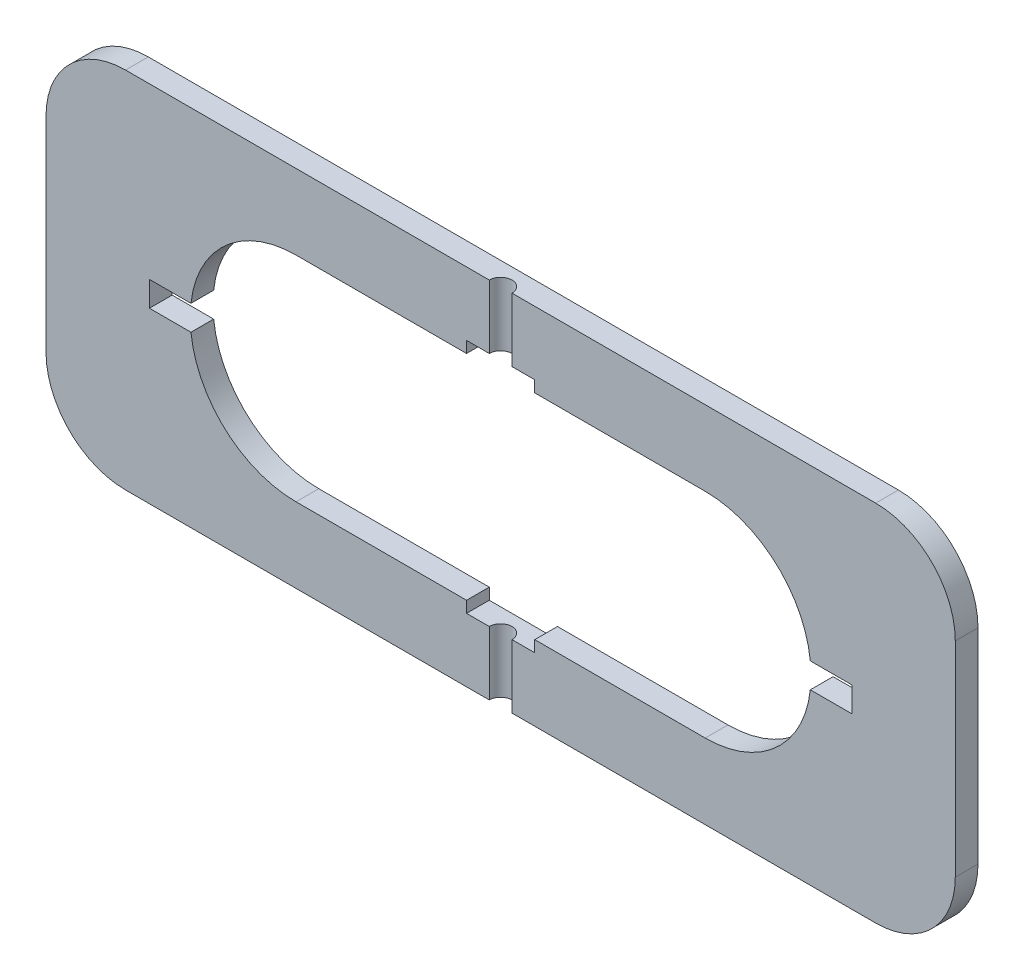
ISO-10303-21;
HEADER;
FILE_DESCRIPTION(('STEP AP214'),'2;1');
FILE_NAME('part.step','',(''),(''),'','','');
FILE_SCHEMA(('AUTOMOTIVE_DESIGN { 1 0 10303 214 1 1 1 1 }'));
ENDSEC;
DATA;
#1=APPLICATION_CONTEXT('core data for automotive mechanical design processes');
#2=APPLICATION_PROTOCOL_DEFINITION('international standard','automotive_design',2000,#1);
#3=PRODUCT_CONTEXT('',#1,'mechanical');
#4=PRODUCT('Part','Part','',(#3));
#5=PRODUCT_RELATED_PRODUCT_CATEGORY('part','',(#4));
#6=PRODUCT_DEFINITION_FORMATION('','',#4);
#7=PRODUCT_DEFINITION_CONTEXT('part definition',#1,'design');
#8=PRODUCT_DEFINITION('design','',#6,#7);
#9=PRODUCT_DEFINITION_SHAPE('','',#8);
#10=(LENGTH_UNIT() NAMED_UNIT(*) SI_UNIT(.MILLI.,.METRE.));
#11=(NAMED_UNIT(*) PLANE_ANGLE_UNIT() SI_UNIT($,.RADIAN.));
#12=(NAMED_UNIT(*) SI_UNIT($,.STERADIAN.) SOLID_ANGLE_UNIT());
#13=UNCERTAINTY_MEASURE_WITH_UNIT(LENGTH_MEASURE(1.E-05),#10,'distance_accuracy_value','');
#14=(GEOMETRIC_REPRESENTATION_CONTEXT(3) GLOBAL_UNCERTAINTY_ASSIGNED_CONTEXT((#13)) GLOBAL_UNIT_ASSIGNED_CONTEXT((#10,
#11,#12)) REPRESENTATION_CONTEXT('',''));
#15=CARTESIAN_POINT('',(0.,0.,0.));
#16=DIRECTION('',(0.,0.,1.));
#17=DIRECTION('',(1.,0.,0.));
#18=AXIS2_PLACEMENT_3D('',#15,#16,#17);
#19=CARTESIAN_POINT('',(165.,45.,10.));
#20=DIRECTION('',(0.,0.,-1.));
#21=DIRECTION('',(-1.,0.,0.));
#22=AXIS2_PLACEMENT_3D('',#19,#20,#21);
#23=PLANE('',#22);
#24=DIRECTION('',(-1.,0.,0.));
#25=VECTOR('',#24,1.);
#26=CARTESIAN_POINT('',(165.,80.,10.));
#27=LINE('',#26,#25);
#28=CARTESIAN_POINT('',(165.,80.,10.));
#29=VERTEX_POINT('',#28);
#30=CARTESIAN_POINT('',(4.99999999999996,80.,10.));
#31=VERTEX_POINT('',#30);
#32=EDGE_CURVE('E252',#29,#31,#27,.T.);
#33=ORIENTED_EDGE('',*,*,#32,.T.);
#34=DIRECTION('',(0.,-1.,0.));
#35=VECTOR('',#34,1.);
#36=CARTESIAN_POINT('',(4.99999999999996,80.,10.));
#37=LINE('',#36,#35);
#38=CARTESIAN_POINT('',(4.99999999999997,52.,10.));
#39=VERTEX_POINT('',#38);
#40=EDGE_CURVE('E237',#31,#39,#37,.T.);
#41=ORIENTED_EDGE('',*,*,#40,.T.);
#42=DIRECTION('',(-1.,0.,0.));
#43=VECTOR('',#42,1.);
#44=CARTESIAN_POINT('',(15.,52.,10.));
#45=LINE('',#44,#43);
#46=CARTESIAN_POINT('',(15.,52.,10.));
#47=VERTEX_POINT('',#46);
#48=EDGE_CURVE('E489',#47,#39,#45,.T.);
#49=ORIENTED_EDGE('',*,*,#48,.F.);
#50=DIRECTION('',(0.,1.,0.));
#51=VECTOR('',#50,1.);
#52=CARTESIAN_POINT('',(15.,-52.,10.));
#53=LINE('',#52,#51);
#54=CARTESIAN_POINT('',(15.,47.,10.));
#55=VERTEX_POINT('',#54);
#56=EDGE_CURVE('E485',#55,#47,#53,.T.);
#57=ORIENTED_EDGE('',*,*,#56,.F.);
#58=DIRECTION('',(-1.,0.,0.));
#59=VECTOR('',#58,1.);
#60=CARTESIAN_POINT('',(89.9999999999997,47.,10.));
#61=LINE('',#60,#59);
#62=CARTESIAN_POINT('',(89.9999999999997,47.,10.));
#63=VERTEX_POINT('',#62);
#64=EDGE_CURVE('E350',#63,#55,#61,.T.);
#65=ORIENTED_EDGE('',*,*,#64,.F.);
#66=CARTESIAN_POINT('',(90.,0.500000000000014,10.));
#67=DIRECTION('',(0.,0.,1.));
#68=DIRECTION('',(-1.,0.,0.));
#69=AXIS2_PLACEMENT_3D('',#66,#67,#68);
#70=CIRCLE('',#69,46.5);
#71=CARTESIAN_POINT('',(136.230401252855,5.5,10.));
#72=VERTEX_POINT('',#71);
#73=EDGE_CURVE('E351',#72,#63,#70,.T.);
#74=ORIENTED_EDGE('',*,*,#73,.F.);
#75=DIRECTION('',(-1.,0.,0.));
#76=VECTOR('',#75,1.);
#77=CARTESIAN_POINT('',(154.5,5.5,10.));
#78=LINE('',#77,#76);
#79=CARTESIAN_POINT('',(154.5,5.5,10.));
#80=VERTEX_POINT('',#79);
#81=EDGE_CURVE('E443',#80,#72,#78,.T.);
#82=ORIENTED_EDGE('',*,*,#81,.F.);
#83=DIRECTION('',(0.,1.,0.));
#84=VECTOR('',#83,1.);
#85=CARTESIAN_POINT('',(154.5,-5.5,10.));
#86=LINE('',#85,#84);
#87=CARTESIAN_POINT('',(154.5,-5.5,10.));
#88=VERTEX_POINT('',#87);
#89=EDGE_CURVE('E455',#88,#80,#86,.T.);
#90=ORIENTED_EDGE('',*,*,#89,.F.);
#91=DIRECTION('',(1.,0.,0.));
#92=VECTOR('',#91,1.);
#93=CARTESIAN_POINT('',(154.5,-5.5,10.));
#94=LINE('',#93,#92);
#95=CARTESIAN_POINT('',(136.230401252855,-5.5,10.));
#96=VERTEX_POINT('',#95);
#97=EDGE_CURVE('E433',#96,#88,#94,.T.);
#98=ORIENTED_EDGE('',*,*,#97,.F.);
#99=CARTESIAN_POINT('',(90.0000000000001,-0.5,10.));
#100=DIRECTION('',(0.,0.,1.));
#101=DIRECTION('',(-1.,0.,0.));
#102=AXIS2_PLACEMENT_3D('',#99,#100,#101);
#103=CIRCLE('',#102,46.5);
#104=CARTESIAN_POINT('',(89.9999999999997,-47.,10.));
#105=VERTEX_POINT('',#104);
#106=EDGE_CURVE('E354',#105,#96,#103,.T.);
#107=ORIENTED_EDGE('',*,*,#106,.F.);
#108=DIRECTION('',(1.,0.,0.));
#109=VECTOR('',#108,1.);
#110=CARTESIAN_POINT('',(89.9999999999997,-47.,10.));
#111=LINE('',#110,#109);
#112=CARTESIAN_POINT('',(15.,-47.,10.));
#113=VERTEX_POINT('',#112);
#114=EDGE_CURVE('E361',#113,#105,#111,.T.);
#115=ORIENTED_EDGE('',*,*,#114,.F.);
#116=CARTESIAN_POINT('',(15.,-52.,10.));
#117=VERTEX_POINT('',#116);
#118=EDGE_CURVE('E486',#117,#113,#53,.T.);
#119=ORIENTED_EDGE('',*,*,#118,.F.);
#120=DIRECTION('',(1.,0.,0.));
#121=VECTOR('',#120,1.);
#122=CARTESIAN_POINT('',(15.,-52.,10.));
#123=LINE('',#122,#121);
#124=CARTESIAN_POINT('',(4.99999999999998,-52.,10.));
#125=VERTEX_POINT('',#124);
#126=EDGE_CURVE('E479',#125,#117,#123,.T.);
#127=ORIENTED_EDGE('',*,*,#126,.F.);
#128=CARTESIAN_POINT('',(4.99999999999998,-80.,10.));
#129=VERTEX_POINT('',#128);
#130=EDGE_CURVE('E54',#125,#129,#37,.T.);
#131=ORIENTED_EDGE('',*,*,#130,.T.);
#132=DIRECTION('',(1.,0.,0.));
#133=VECTOR('',#132,1.);
#134=CARTESIAN_POINT('',(165.,-80.,10.));
#135=LINE('',#134,#133);
#136=CARTESIAN_POINT('',(165.,-80.,10.));
#137=VERTEX_POINT('',#136);
#138=EDGE_CURVE('E272',#129,#137,#135,.T.);
#139=ORIENTED_EDGE('',*,*,#138,.T.);
#140=CARTESIAN_POINT('',(165.,-45.,10.));
#141=DIRECTION('',(0.,0.,1.));
#142=DIRECTION('',(-1.,0.,0.));
#143=AXIS2_PLACEMENT_3D('',#140,#141,#142);
#144=CIRCLE('',#143,35.);
#145=CARTESIAN_POINT('',(200.,-44.9999999999997,10.));
#146=VERTEX_POINT('',#145);
#147=EDGE_CURVE('E276',#137,#146,#144,.T.);
#148=ORIENTED_EDGE('',*,*,#147,.T.);
#149=DIRECTION('',(0.,1.,0.));
#150=VECTOR('',#149,1.);
#151=CARTESIAN_POINT('',(200.,44.9999999999998,10.));
#152=LINE('',#151,#150);
#153=CARTESIAN_POINT('',(200.,44.9999999999998,10.));
#154=VERTEX_POINT('',#153);
#155=EDGE_CURVE('E278',#146,#154,#152,.T.);
#156=ORIENTED_EDGE('',*,*,#155,.T.);
#157=CARTESIAN_POINT('',(165.,45.,10.));
#158=DIRECTION('',(0.,0.,1.));
#159=DIRECTION('',(-1.,0.,0.));
#160=AXIS2_PLACEMENT_3D('',#157,#158,#159);
#161=CIRCLE('',#160,35.);
#162=EDGE_CURVE('E260',#154,#29,#161,.T.);
#163=ORIENTED_EDGE('',*,*,#162,.T.);
#164=EDGE_LOOP('',(#33,#41,#49,#57,#65,#74,#82,#90,#98,#107,#115,#119,#127,#131,#139,#148,#156,#163));
#165=FACE_BOUND('',#164,.T.);
#166=ADVANCED_FACE('F31',(#165),#23,.F.);
#167=CARTESIAN_POINT('',(89.9999999999997,-47.,0.));
#168=DIRECTION('',(0.,-1.,0.));
#169=DIRECTION('',(1.,0.,0.));
#170=AXIS2_PLACEMENT_3D('',#167,#168,#169);
#171=PLANE('',#170);
#172=CARTESIAN_POINT('',(-89.9999999999996,-47.,10.));
#173=VERTEX_POINT('',#172);
#174=CARTESIAN_POINT('',(-15.,-47.,10.));
#175=VERTEX_POINT('',#174);
#176=EDGE_CURVE('E362',#173,#175,#111,.T.);
#177=ORIENTED_EDGE('',*,*,#176,.T.);
#178=DIRECTION('',(0.,0.,-1.));
#179=VECTOR('',#178,1.);
#180=CARTESIAN_POINT('',(-15.,-47.,0.));
#181=LINE('',#180,#179);
#182=CARTESIAN_POINT('',(-15.,-47.,0.));
#183=VERTEX_POINT('',#182);
#184=EDGE_CURVE('E426',#175,#183,#181,.T.);
#185=ORIENTED_EDGE('',*,*,#184,.T.);
#186=DIRECTION('',(1.,0.,0.));
#187=VECTOR('',#186,1.);
#188=CARTESIAN_POINT('',(89.9999999999997,-47.,0.));
#189=LINE('',#188,#187);
#190=CARTESIAN_POINT('',(-89.9999999999996,-47.,0.));
#191=VERTEX_POINT('',#190);
#192=EDGE_CURVE('E374',#191,#183,#189,.T.);
#193=ORIENTED_EDGE('',*,*,#192,.F.);
#194=DIRECTION('',(0.,0.,1.));
#195=VECTOR('',#194,1.);
#196=CARTESIAN_POINT('',(-89.9999999999996,-47.,0.));
#197=LINE('',#196,#195);
#198=EDGE_CURVE('E368',#191,#173,#197,.T.);
#199=ORIENTED_EDGE('',*,*,#198,.T.);
#200=EDGE_LOOP('',(#177,#185,#193,#199));
#201=FACE_BOUND('',#200,.T.);
#202=ADVANCED_FACE('F425',(#201),#171,.F.);
#203=CARTESIAN_POINT('',(89.9999999999997,47.,0.));
#204=DIRECTION('',(0.,1.,0.));
#205=DIRECTION('',(-1.,0.,0.));
#206=AXIS2_PLACEMENT_3D('',#203,#204,#205);
#207=PLANE('',#206);
#208=DIRECTION('',(-1.,0.,0.));
#209=VECTOR('',#208,1.);
#210=CARTESIAN_POINT('',(89.9999999999997,47.,0.));
#211=LINE('',#210,#209);
#212=CARTESIAN_POINT('',(-15.,47.,0.));
#213=VERTEX_POINT('',#212);
#214=CARTESIAN_POINT('',(-89.9999999999996,47.,0.));
#215=VERTEX_POINT('',#214);
#216=EDGE_CURVE('E337',#213,#215,#211,.T.);
#217=ORIENTED_EDGE('',*,*,#216,.F.);
#218=DIRECTION('',(0.,0.,1.));
#219=VECTOR('',#218,1.);
#220=CARTESIAN_POINT('',(-15.,47.,0.));
#221=LINE('',#220,#219);
#222=CARTESIAN_POINT('',(-15.,47.,10.));
#223=VERTEX_POINT('',#222);
#224=EDGE_CURVE('E39',#213,#223,#221,.T.);
#225=ORIENTED_EDGE('',*,*,#224,.T.);
#226=CARTESIAN_POINT('',(-89.9999999999996,47.,10.));
#227=VERTEX_POINT('',#226);
#228=EDGE_CURVE('E335',#223,#227,#61,.T.);
#229=ORIENTED_EDGE('',*,*,#228,.T.);
#230=DIRECTION('',(0.,0.,1.));
#231=VECTOR('',#230,1.);
#232=CARTESIAN_POINT('',(-89.9999999999996,47.,0.));
#233=LINE('',#232,#231);
#234=EDGE_CURVE('E371',#215,#227,#233,.T.);
#235=ORIENTED_EDGE('',*,*,#234,.F.);
#236=EDGE_LOOP('',(#217,#225,#229,#235));
#237=FACE_BOUND('',#236,.T.);
#238=ADVANCED_FACE('F333',(#237),#207,.F.);
#239=CARTESIAN_POINT('',(165.,45.,10.));
#240=DIRECTION('',(0.,0.,-1.));
#241=DIRECTION('',(-1.,0.,0.));
#242=AXIS2_PLACEMENT_3D('',#239,#240,#241);
#243=CYLINDRICAL_SURFACE('',#242,35.);
#244=CARTESIAN_POINT('',(165.,45.,0.));
#245=DIRECTION('',(0.,0.,1.));
#246=DIRECTION('',(-1.,0.,0.));
#247=AXIS2_PLACEMENT_3D('',#244,#245,#246);
#248=CIRCLE('',#247,35.);
#249=CARTESIAN_POINT('',(200.,44.9999999999998,0.));
#250=VERTEX_POINT('',#249);
#251=CARTESIAN_POINT('',(165.,80.,0.));
#252=VERTEX_POINT('',#251);
#253=EDGE_CURVE('E281',#250,#252,#248,.T.);
#254=ORIENTED_EDGE('',*,*,#253,.T.);
#255=DIRECTION('',(0.,0.,-1.));
#256=VECTOR('',#255,1.);
#257=CARTESIAN_POINT('',(165.,80.,10.));
#258=LINE('',#257,#256);
#259=EDGE_CURVE('E319',#29,#252,#258,.T.);
#260=ORIENTED_EDGE('',*,*,#259,.F.);
#261=ORIENTED_EDGE('',*,*,#162,.F.);
#262=DIRECTION('',(0.,0.,-1.));
#263=VECTOR('',#262,1.);
#264=CARTESIAN_POINT('',(200.,44.9999999999998,10.));
#265=LINE('',#264,#263);
#266=EDGE_CURVE('E280',#154,#250,#265,.T.);
#267=ORIENTED_EDGE('',*,*,#266,.T.);
#268=EDGE_LOOP('',(#254,#260,#261,#267));
#269=FACE_BOUND('',#268,.T.);
#270=ADVANCED_FACE('F33',(#269),#243,.T.);
#271=CARTESIAN_POINT('',(165.,80.,10.));
#272=DIRECTION('',(0.,-1.,0.));
#273=DIRECTION('',(1.,0.,0.));
#274=AXIS2_PLACEMENT_3D('',#271,#272,#273);
#275=PLANE('',#274);
#276=CARTESIAN_POINT('',(-5.00000000000004,80.,10.));
#277=VERTEX_POINT('',#276);
#278=CARTESIAN_POINT('',(-165.,80.,10.));
#279=VERTEX_POINT('',#278);
#280=EDGE_CURVE('E255',#277,#279,#27,.T.);
#281=ORIENTED_EDGE('',*,*,#280,.F.);
#282=CARTESIAN_POINT('',(0.,80.,10.));
#283=DIRECTION('',(0.,-1.,0.));
#284=DIRECTION('',(1.,0.,0.));
#285=AXIS2_PLACEMENT_3D('',#282,#283,#284);
#286=CIRCLE('',#285,5.);
#287=EDGE_CURVE('E240',#277,#31,#286,.T.);
#288=ORIENTED_EDGE('',*,*,#287,.T.);
#289=ORIENTED_EDGE('',*,*,#32,.F.);
#290=ORIENTED_EDGE('',*,*,#259,.T.);
#291=DIRECTION('',(-1.,0.,0.));
#292=VECTOR('',#291,1.);
#293=CARTESIAN_POINT('',(165.,80.,0.));
#294=LINE('',#293,#292);
#295=CARTESIAN_POINT('',(-165.,80.,0.));
#296=VERTEX_POINT('',#295);
#297=EDGE_CURVE('E284',#252,#296,#294,.T.);
#298=ORIENTED_EDGE('',*,*,#297,.T.);
#299=DIRECTION('',(0.,0.,-1.));
#300=VECTOR('',#299,1.);
#301=CARTESIAN_POINT('',(-165.,80.,10.));
#302=LINE('',#301,#300);
#303=EDGE_CURVE('E316',#279,#296,#302,.T.);
#304=ORIENTED_EDGE('',*,*,#303,.F.);
#305=EDGE_LOOP('',(#281,#288,#289,#290,#298,#304));
#306=FACE_BOUND('',#305,.T.);
#307=ADVANCED_FACE('F250',(#306),#275,.F.);
#308=CARTESIAN_POINT('',(-165.,45.,10.));
#309=DIRECTION('',(0.,0.,-1.));
#310=DIRECTION('',(-1.,0.,0.));
#311=AXIS2_PLACEMENT_3D('',#308,#309,#310);
#312=CYLINDRICAL_SURFACE('',#311,35.);
#313=CARTESIAN_POINT('',(-165.,45.,0.));
#314=DIRECTION('',(0.,0.,1.));
#315=DIRECTION('',(1.,0.,0.));
#316=AXIS2_PLACEMENT_3D('',#313,#314,#315);
#317=CIRCLE('',#316,35.);
#318=CARTESIAN_POINT('',(-200.,44.9999999999997,0.));
#319=VERTEX_POINT('',#318);
#320=EDGE_CURVE('E287',#296,#319,#317,.T.);
#321=ORIENTED_EDGE('',*,*,#320,.T.);
#322=DIRECTION('',(0.,0.,-1.));
#323=VECTOR('',#322,1.);
#324=CARTESIAN_POINT('',(-200.,44.9999999999997,10.));
#325=LINE('',#324,#323);
#326=CARTESIAN_POINT('',(-200.,44.9999999999997,10.));
#327=VERTEX_POINT('',#326);
#328=EDGE_CURVE('E313',#327,#319,#325,.T.);
#329=ORIENTED_EDGE('',*,*,#328,.F.);
#330=CARTESIAN_POINT('',(-165.,45.,10.));
#331=DIRECTION('',(0.,0.,1.));
#332=DIRECTION('',(1.,0.,0.));
#333=AXIS2_PLACEMENT_3D('',#330,#331,#332);
#334=CIRCLE('',#333,35.);
#335=EDGE_CURVE('E262',#279,#327,#334,.T.);
#336=ORIENTED_EDGE('',*,*,#335,.F.);
#337=ORIENTED_EDGE('',*,*,#303,.T.);
#338=EDGE_LOOP('',(#321,#329,#336,#337));
#339=FACE_BOUND('',#338,.T.);
#340=ADVANCED_FACE('F543',(#339),#312,.T.);
#341=CARTESIAN_POINT('',(-200.,44.9999999999997,10.));
#342=DIRECTION('',(1.,0.,0.));
#343=DIRECTION('',(0.,1.,0.));
#344=AXIS2_PLACEMENT_3D('',#341,#342,#343);
#345=PLANE('',#344);
#346=DIRECTION('',(0.,-1.,0.));
#347=VECTOR('',#346,1.);
#348=CARTESIAN_POINT('',(-200.,44.9999999999997,0.));
#349=LINE('',#348,#347);
#350=CARTESIAN_POINT('',(-200.,-44.9999999999998,0.));
#351=VERTEX_POINT('',#350);
#352=EDGE_CURVE('E289',#319,#351,#349,.T.);
#353=ORIENTED_EDGE('',*,*,#352,.T.);
#354=DIRECTION('',(0.,0.,-1.));
#355=VECTOR('',#354,1.);
#356=CARTESIAN_POINT('',(-200.,-44.9999999999998,10.));
#357=LINE('',#356,#355);
#358=CARTESIAN_POINT('',(-200.,-44.9999999999998,10.));
#359=VERTEX_POINT('',#358);
#360=EDGE_CURVE('E310',#359,#351,#357,.T.);
#361=ORIENTED_EDGE('',*,*,#360,.F.);
#362=DIRECTION('',(0.,-1.,0.));
#363=VECTOR('',#362,1.);
#364=CARTESIAN_POINT('',(-200.,44.9999999999997,10.));
#365=LINE('',#364,#363);
#366=EDGE_CURVE('E264',#327,#359,#365,.T.);
#367=ORIENTED_EDGE('',*,*,#366,.F.);
#368=ORIENTED_EDGE('',*,*,#328,.T.);
#369=EDGE_LOOP('',(#353,#361,#367,#368));
#370=FACE_BOUND('',#369,.T.);
#371=ADVANCED_FACE('F549',(#370),#345,.F.);
#372=CARTESIAN_POINT('',(-165.,-45.,10.));
#373=DIRECTION('',(0.,0.,-1.));
#374=DIRECTION('',(-1.,0.,0.));
#375=AXIS2_PLACEMENT_3D('',#372,#373,#374);
#376=CYLINDRICAL_SURFACE('',#375,35.);
#377=CARTESIAN_POINT('',(-165.,-45.,0.));
#378=DIRECTION('',(0.,0.,1.));
#379=DIRECTION('',(-1.,0.,0.));
#380=AXIS2_PLACEMENT_3D('',#377,#378,#379);
#381=CIRCLE('',#380,35.);
#382=CARTESIAN_POINT('',(-165.,-80.,0.));
#383=VERTEX_POINT('',#382);
#384=EDGE_CURVE('E291',#351,#383,#381,.T.);
#385=ORIENTED_EDGE('',*,*,#384,.T.);
#386=DIRECTION('',(0.,0.,-1.));
#387=VECTOR('',#386,1.);
#388=CARTESIAN_POINT('',(-165.,-80.,10.));
#389=LINE('',#388,#387);
#390=CARTESIAN_POINT('',(-165.,-80.,10.));
#391=VERTEX_POINT('',#390);
#392=EDGE_CURVE('E307',#391,#383,#389,.T.);
#393=ORIENTED_EDGE('',*,*,#392,.F.);
#394=CARTESIAN_POINT('',(-165.,-45.,10.));
#395=DIRECTION('',(0.,0.,1.));
#396=DIRECTION('',(-1.,0.,0.));
#397=AXIS2_PLACEMENT_3D('',#394,#395,#396);
#398=CIRCLE('',#397,35.);
#399=EDGE_CURVE('E270',#359,#391,#398,.T.);
#400=ORIENTED_EDGE('',*,*,#399,.F.);
#401=ORIENTED_EDGE('',*,*,#360,.T.);
#402=EDGE_LOOP('',(#385,#393,#400,#401));
#403=FACE_BOUND('',#402,.T.);
#404=ADVANCED_FACE('F553',(#403),#376,.T.);
#405=CARTESIAN_POINT('',(165.,-80.,10.));
#406=DIRECTION('',(0.,1.,0.));
#407=DIRECTION('',(-1.,0.,0.));
#408=AXIS2_PLACEMENT_3D('',#405,#406,#407);
#409=PLANE('',#408);
#410=ORIENTED_EDGE('',*,*,#138,.F.);
#411=CARTESIAN_POINT('',(0.,-80.,10.));
#412=DIRECTION('',(0.,-1.,0.));
#413=DIRECTION('',(1.,0.,0.));
#414=AXIS2_PLACEMENT_3D('',#411,#412,#413);
#415=CIRCLE('',#414,5.);
#416=CARTESIAN_POINT('',(-5.00000000000002,-80.,10.));
#417=VERTEX_POINT('',#416);
#418=EDGE_CURVE('E257',#417,#129,#415,.T.);
#419=ORIENTED_EDGE('',*,*,#418,.F.);
#420=EDGE_CURVE('E273',#391,#417,#135,.T.);
#421=ORIENTED_EDGE('',*,*,#420,.F.);
#422=ORIENTED_EDGE('',*,*,#392,.T.);
#423=DIRECTION('',(1.,0.,0.));
#424=VECTOR('',#423,1.);
#425=CARTESIAN_POINT('',(165.,-80.,0.));
#426=LINE('',#425,#424);
#427=CARTESIAN_POINT('',(165.,-80.,0.));
#428=VERTEX_POINT('',#427);
#429=EDGE_CURVE('E293',#383,#428,#426,.T.);
#430=ORIENTED_EDGE('',*,*,#429,.T.);
#431=DIRECTION('',(0.,0.,-1.));
#432=VECTOR('',#431,1.);
#433=CARTESIAN_POINT('',(165.,-80.,10.));
#434=LINE('',#433,#432);
#435=EDGE_CURVE('E304',#137,#428,#434,.T.);
#436=ORIENTED_EDGE('',*,*,#435,.F.);
#437=EDGE_LOOP('',(#410,#419,#421,#422,#430,#436));
#438=FACE_BOUND('',#437,.T.);
#439=ADVANCED_FACE('F526',(#438),#409,.F.);
#440=CARTESIAN_POINT('',(165.,-45.,10.));
#441=DIRECTION('',(0.,0.,-1.));
#442=DIRECTION('',(-1.,0.,0.));
#443=AXIS2_PLACEMENT_3D('',#440,#441,#442);
#444=CYLINDRICAL_SURFACE('',#443,35.);
#445=CARTESIAN_POINT('',(165.,-45.,0.));
#446=DIRECTION('',(0.,0.,1.));
#447=DIRECTION('',(-1.,0.,0.));
#448=AXIS2_PLACEMENT_3D('',#445,#446,#447);
#449=CIRCLE('',#448,35.);
#450=CARTESIAN_POINT('',(200.,-44.9999999999997,0.));
#451=VERTEX_POINT('',#450);
#452=EDGE_CURVE('E295',#428,#451,#449,.T.);
#453=ORIENTED_EDGE('',*,*,#452,.T.);
#454=DIRECTION('',(0.,0.,-1.));
#455=VECTOR('',#454,1.);
#456=CARTESIAN_POINT('',(200.,-44.9999999999997,10.));
#457=LINE('',#456,#455);
#458=EDGE_CURVE('E301',#146,#451,#457,.T.);
#459=ORIENTED_EDGE('',*,*,#458,.F.);
#460=ORIENTED_EDGE('',*,*,#147,.F.);
#461=ORIENTED_EDGE('',*,*,#435,.T.);
#462=EDGE_LOOP('',(#453,#459,#460,#461));
#463=FACE_BOUND('',#462,.T.);
#464=ADVANCED_FACE('F532',(#463),#444,.T.);
#465=CARTESIAN_POINT('',(200.,44.9999999999998,10.));
#466=DIRECTION('',(-1.,0.,0.));
#467=DIRECTION('',(0.,-1.,0.));
#468=AXIS2_PLACEMENT_3D('',#465,#466,#467);
#469=PLANE('',#468);
#470=DIRECTION('',(0.,1.,0.));
#471=VECTOR('',#470,1.);
#472=CARTESIAN_POINT('',(200.,44.9999999999998,0.));
#473=LINE('',#472,#471);
#474=EDGE_CURVE('E297',#451,#250,#473,.T.);
#475=ORIENTED_EDGE('',*,*,#474,.T.);
#476=ORIENTED_EDGE('',*,*,#266,.F.);
#477=ORIENTED_EDGE('',*,*,#155,.F.);
#478=ORIENTED_EDGE('',*,*,#458,.T.);
#479=EDGE_LOOP('',(#475,#476,#477,#478));
#480=FACE_BOUND('',#479,.T.);
#481=ADVANCED_FACE('F536',(#480),#469,.F.);
#482=ORIENTED_EDGE('',*,*,#420,.T.);
#483=DIRECTION('',(0.,-1.,0.));
#484=VECTOR('',#483,1.);
#485=CARTESIAN_POINT('',(-5.00000000000004,80.,10.));
#486=LINE('',#485,#484);
#487=CARTESIAN_POINT('',(-5.00000000000002,-52.,10.));
#488=VERTEX_POINT('',#487);
#489=EDGE_CURVE('E256',#417,#488,#486,.F.);
#490=ORIENTED_EDGE('',*,*,#489,.T.);
#491=CARTESIAN_POINT('',(-15.,-52.,10.));
#492=VERTEX_POINT('',#491);
#493=EDGE_CURVE('E476',#492,#488,#123,.T.);
#494=ORIENTED_EDGE('',*,*,#493,.F.);
#495=DIRECTION('',(0.,-1.,0.));
#496=VECTOR('',#495,1.);
#497=CARTESIAN_POINT('',(-15.,-52.,10.));
#498=LINE('',#497,#496);
#499=EDGE_CURVE('E246',#175,#492,#498,.T.);
#500=ORIENTED_EDGE('',*,*,#499,.F.);
#501=ORIENTED_EDGE('',*,*,#176,.F.);
#502=CARTESIAN_POINT('',(-90.,-0.500000000000021,10.));
#503=DIRECTION('',(0.,0.,1.));
#504=DIRECTION('',(-1.,0.,0.));
#505=AXIS2_PLACEMENT_3D('',#502,#503,#504);
#506=CIRCLE('',#505,46.5);
#507=CARTESIAN_POINT('',(-136.230401252855,-5.5,10.));
#508=VERTEX_POINT('',#507);
#509=EDGE_CURVE('E359',#508,#173,#506,.T.);
#510=ORIENTED_EDGE('',*,*,#509,.F.);
#511=CARTESIAN_POINT('',(-154.5,-5.5,10.));
#512=VERTEX_POINT('',#511);
#513=EDGE_CURVE('E453',#512,#508,#94,.T.);
#514=ORIENTED_EDGE('',*,*,#513,.F.);
#515=DIRECTION('',(0.,-1.,0.));
#516=VECTOR('',#515,1.);
#517=CARTESIAN_POINT('',(-154.5,-5.5,10.));
#518=LINE('',#517,#516);
#519=CARTESIAN_POINT('',(-154.5,5.5,10.));
#520=VERTEX_POINT('',#519);
#521=EDGE_CURVE('E429',#520,#512,#518,.T.);
#522=ORIENTED_EDGE('',*,*,#521,.F.);
#523=CARTESIAN_POINT('',(-136.230401252855,5.5,10.));
#524=VERTEX_POINT('',#523);
#525=EDGE_CURVE('E458',#524,#520,#78,.T.);
#526=ORIENTED_EDGE('',*,*,#525,.F.);
#527=CARTESIAN_POINT('',(-90.,0.499999999999973,10.));
#528=DIRECTION('',(0.,0.,1.));
#529=DIRECTION('',(1.,0.,0.));
#530=AXIS2_PLACEMENT_3D('',#527,#528,#529);
#531=CIRCLE('',#530,46.5);
#532=EDGE_CURVE('E349',#227,#524,#531,.T.);
#533=ORIENTED_EDGE('',*,*,#532,.F.);
#534=ORIENTED_EDGE('',*,*,#228,.F.);
#535=CARTESIAN_POINT('',(-15.,52.,10.));
#536=VERTEX_POINT('',#535);
#537=EDGE_CURVE('E346',#536,#223,#498,.T.);
#538=ORIENTED_EDGE('',*,*,#537,.F.);
#539=CARTESIAN_POINT('',(-5.00000000000004,52.,10.));
#540=VERTEX_POINT('',#539);
#541=EDGE_CURVE('E488',#540,#536,#45,.T.);
#542=ORIENTED_EDGE('',*,*,#541,.F.);
#543=EDGE_CURVE('E46',#540,#277,#486,.F.);
#544=ORIENTED_EDGE('',*,*,#543,.T.);
#545=ORIENTED_EDGE('',*,*,#280,.T.);
#546=ORIENTED_EDGE('',*,*,#335,.T.);
#547=ORIENTED_EDGE('',*,*,#366,.T.);
#548=ORIENTED_EDGE('',*,*,#399,.T.);
#549=EDGE_LOOP('',(#482,#490,#494,#500,#501,#510,#514,#522,#526,#533,#534,#538,#542,#544,#545,
#546,#547,#548));
#550=FACE_BOUND('',#549,.T.);
#551=ADVANCED_FACE('F344',(#550),#23,.F.);
#552=CARTESIAN_POINT('',(165.,45.,0.));
#553=DIRECTION('',(0.,0.,-1.));
#554=DIRECTION('',(-1.,0.,0.));
#555=AXIS2_PLACEMENT_3D('',#552,#553,#554);
#556=PLANE('',#555);
#557=DIRECTION('',(0.,-1.,0.));
#558=VECTOR('',#557,1.);
#559=CARTESIAN_POINT('',(-15.,-52.,0.));
#560=LINE('',#559,#558);
#561=CARTESIAN_POINT('',(-15.,52.,0.));
#562=VERTEX_POINT('',#561);
#563=EDGE_CURVE('E514',#562,#213,#560,.T.);
#564=ORIENTED_EDGE('',*,*,#563,.T.);
#565=ORIENTED_EDGE('',*,*,#216,.T.);
#566=CARTESIAN_POINT('',(-90.,0.499999999999973,0.));
#567=DIRECTION('',(0.,0.,1.));
#568=DIRECTION('',(1.,0.,0.));
#569=AXIS2_PLACEMENT_3D('',#566,#567,#568);
#570=CIRCLE('',#569,46.5);
#571=CARTESIAN_POINT('',(-136.230401252855,5.5,0.));
#572=VERTEX_POINT('',#571);
#573=EDGE_CURVE('E407',#215,#572,#570,.T.);
#574=ORIENTED_EDGE('',*,*,#573,.T.);
#575=DIRECTION('',(-1.,0.,0.));
#576=VECTOR('',#575,1.);
#577=CARTESIAN_POINT('',(154.5,5.5,0.));
#578=LINE('',#577,#576);
#579=CARTESIAN_POINT('',(-154.5,5.5,0.));
#580=VERTEX_POINT('',#579);
#581=EDGE_CURVE('E448',#572,#580,#578,.T.);
#582=ORIENTED_EDGE('',*,*,#581,.T.);
#583=DIRECTION('',(0.,-1.,0.));
#584=VECTOR('',#583,1.);
#585=CARTESIAN_POINT('',(-154.5,-5.5,0.));
#586=LINE('',#585,#584);
#587=CARTESIAN_POINT('',(-154.5,-5.5,0.));
#588=VERTEX_POINT('',#587);
#589=EDGE_CURVE('E440',#580,#588,#586,.T.);
#590=ORIENTED_EDGE('',*,*,#589,.T.);
#591=DIRECTION('',(1.,0.,0.));
#592=VECTOR('',#591,1.);
#593=CARTESIAN_POINT('',(154.5,-5.5,0.));
#594=LINE('',#593,#592);
#595=CARTESIAN_POINT('',(-136.230401252855,-5.5,0.));
#596=VERTEX_POINT('',#595);
#597=EDGE_CURVE('E418',#588,#596,#594,.T.);
#598=ORIENTED_EDGE('',*,*,#597,.T.);
#599=CARTESIAN_POINT('',(-90.,-0.500000000000021,0.));
#600=DIRECTION('',(0.,0.,1.));
#601=DIRECTION('',(-1.,0.,0.));
#602=AXIS2_PLACEMENT_3D('',#599,#600,#601);
#603=CIRCLE('',#602,46.5);
#604=EDGE_CURVE('E385',#596,#191,#603,.T.);
#605=ORIENTED_EDGE('',*,*,#604,.T.);
#606=ORIENTED_EDGE('',*,*,#192,.T.);
#607=CARTESIAN_POINT('',(-15.,-52.,0.));
#608=VERTEX_POINT('',#607);
#609=EDGE_CURVE('E491',#183,#608,#560,.T.);
#610=ORIENTED_EDGE('',*,*,#609,.T.);
#611=DIRECTION('',(1.,0.,0.));
#612=VECTOR('',#611,1.);
#613=CARTESIAN_POINT('',(15.,-52.,0.));
#614=LINE('',#613,#612);
#615=CARTESIAN_POINT('',(15.,-52.,0.));
#616=VERTEX_POINT('',#615);
#617=EDGE_CURVE('E511',#608,#616,#614,.T.);
#618=ORIENTED_EDGE('',*,*,#617,.T.);
#619=DIRECTION('',(0.,1.,0.));
#620=VECTOR('',#619,1.);
#621=CARTESIAN_POINT('',(15.,-52.,0.));
#622=LINE('',#621,#620);
#623=CARTESIAN_POINT('',(15.,-47.,0.));
#624=VERTEX_POINT('',#623);
#625=EDGE_CURVE('E503',#616,#624,#622,.T.);
#626=ORIENTED_EDGE('',*,*,#625,.T.);
#627=CARTESIAN_POINT('',(89.9999999999997,-47.,0.));
#628=VERTEX_POINT('',#627);
#629=EDGE_CURVE('E380',#624,#628,#189,.T.);
#630=ORIENTED_EDGE('',*,*,#629,.T.);
#631=CARTESIAN_POINT('',(90.0000000000001,-0.5,0.));
#632=DIRECTION('',(0.,0.,1.));
#633=DIRECTION('',(-1.,0.,0.));
#634=AXIS2_PLACEMENT_3D('',#631,#632,#633);
#635=CIRCLE('',#634,46.5);
#636=CARTESIAN_POINT('',(136.230401252855,-5.5,0.));
#637=VERTEX_POINT('',#636);
#638=EDGE_CURVE('E365',#628,#637,#635,.T.);
#639=ORIENTED_EDGE('',*,*,#638,.T.);
#640=CARTESIAN_POINT('',(154.5,-5.5,0.));
#641=VERTEX_POINT('',#640);
#642=EDGE_CURVE('E442',#637,#641,#594,.T.);
#643=ORIENTED_EDGE('',*,*,#642,.T.);
#644=DIRECTION('',(0.,1.,0.));
#645=VECTOR('',#644,1.);
#646=CARTESIAN_POINT('',(154.5,-5.5,0.));
#647=LINE('',#646,#645);
#648=CARTESIAN_POINT('',(154.5,5.5,0.));
#649=VERTEX_POINT('',#648);
#650=EDGE_CURVE('E445',#641,#649,#647,.T.);
#651=ORIENTED_EDGE('',*,*,#650,.T.);
#652=CARTESIAN_POINT('',(136.230401252855,5.5,0.));
#653=VERTEX_POINT('',#652);
#654=EDGE_CURVE('E449',#649,#653,#578,.T.);
#655=ORIENTED_EDGE('',*,*,#654,.T.);
#656=CARTESIAN_POINT('',(90.,0.500000000000014,0.));
#657=DIRECTION('',(0.,0.,1.));
#658=DIRECTION('',(-1.,0.,0.));
#659=AXIS2_PLACEMENT_3D('',#656,#657,#658);
#660=CIRCLE('',#659,46.5);
#661=CARTESIAN_POINT('',(89.9999999999997,47.,0.));
#662=VERTEX_POINT('',#661);
#663=EDGE_CURVE('E403',#653,#662,#660,.T.);
#664=ORIENTED_EDGE('',*,*,#663,.T.);
#665=CARTESIAN_POINT('',(15.,47.,0.));
#666=VERTEX_POINT('',#665);
#667=EDGE_CURVE('E405',#662,#666,#211,.T.);
#668=ORIENTED_EDGE('',*,*,#667,.T.);
#669=CARTESIAN_POINT('',(15.,52.,0.));
#670=VERTEX_POINT('',#669);
#671=EDGE_CURVE('E507',#666,#670,#622,.T.);
#672=ORIENTED_EDGE('',*,*,#671,.T.);
#673=DIRECTION('',(-1.,0.,0.));
#674=VECTOR('',#673,1.);
#675=CARTESIAN_POINT('',(15.,52.,0.));
#676=LINE('',#675,#674);
#677=EDGE_CURVE('E482',#670,#562,#676,.T.);
#678=ORIENTED_EDGE('',*,*,#677,.T.);
#679=EDGE_LOOP('',(#564,#565,#574,#582,#590,#598,#605,#606,#610,#618,#626,#630,#639,#643,#651,
#655,#664,#668,#672,#678));
#680=FACE_BOUND('',#679,.T.);
#681=ORIENTED_EDGE('',*,*,#253,.F.);
#682=ORIENTED_EDGE('',*,*,#474,.F.);
#683=ORIENTED_EDGE('',*,*,#452,.F.);
#684=ORIENTED_EDGE('',*,*,#429,.F.);
#685=ORIENTED_EDGE('',*,*,#384,.F.);
#686=ORIENTED_EDGE('',*,*,#352,.F.);
#687=ORIENTED_EDGE('',*,*,#320,.F.);
#688=ORIENTED_EDGE('',*,*,#297,.F.);
#689=EDGE_LOOP('',(#681,#682,#683,#684,#685,#686,#687,#688));
#690=FACE_BOUND('',#689,.T.);
#691=ADVANCED_FACE('F414',(#680,#690),#556,.T.);
#692=CARTESIAN_POINT('',(90.0000000000001,-0.5,0.));
#693=DIRECTION('',(0.,0.,1.));
#694=DIRECTION('',(1.,0.,0.));
#695=AXIS2_PLACEMENT_3D('',#692,#693,#694);
#696=CYLINDRICAL_SURFACE('',#695,46.5);
#697=ORIENTED_EDGE('',*,*,#106,.T.);
#698=DIRECTION('',(0.,0.,1.));
#699=VECTOR('',#698,1.);
#700=CARTESIAN_POINT('',(136.230401252855,-5.5,0.));
#701=LINE('',#700,#699);
#702=EDGE_CURVE('E389',#96,#637,#701,.F.);
#703=ORIENTED_EDGE('',*,*,#702,.T.);
#704=ORIENTED_EDGE('',*,*,#638,.F.);
#705=DIRECTION('',(0.,0.,1.));
#706=VECTOR('',#705,1.);
#707=CARTESIAN_POINT('',(89.9999999999997,-47.,0.));
#708=LINE('',#707,#706);
#709=EDGE_CURVE('E285',#628,#105,#708,.T.);
#710=ORIENTED_EDGE('',*,*,#709,.T.);
#711=EDGE_LOOP('',(#697,#703,#704,#710));
#712=FACE_BOUND('',#711,.T.);
#713=ADVANCED_FACE('F592',(#712),#696,.F.);
#714=ORIENTED_EDGE('',*,*,#629,.F.);
#715=DIRECTION('',(0.,0.,1.));
#716=VECTOR('',#715,1.);
#717=CARTESIAN_POINT('',(15.,-47.,0.));
#718=LINE('',#717,#716);
#719=EDGE_CURVE('E430',#624,#113,#718,.T.);
#720=ORIENTED_EDGE('',*,*,#719,.T.);
#721=ORIENTED_EDGE('',*,*,#114,.T.);
#722=ORIENTED_EDGE('',*,*,#709,.F.);
#723=EDGE_LOOP('',(#714,#720,#721,#722));
#724=FACE_BOUND('',#723,.T.);
#725=ADVANCED_FACE('F584',(#724),#171,.F.);
#726=CARTESIAN_POINT('',(-90.,-0.500000000000021,0.));
#727=DIRECTION('',(0.,0.,1.));
#728=DIRECTION('',(1.,0.,0.));
#729=AXIS2_PLACEMENT_3D('',#726,#727,#728);
#730=CYLINDRICAL_SURFACE('',#729,46.5);
#731=ORIENTED_EDGE('',*,*,#604,.F.);
#732=DIRECTION('',(0.,0.,1.));
#733=VECTOR('',#732,1.);
#734=CARTESIAN_POINT('',(-136.230401252855,-5.5,0.));
#735=LINE('',#734,#733);
#736=EDGE_CURVE('E324',#596,#508,#735,.T.);
#737=ORIENTED_EDGE('',*,*,#736,.T.);
#738=ORIENTED_EDGE('',*,*,#509,.T.);
#739=ORIENTED_EDGE('',*,*,#198,.F.);
#740=EDGE_LOOP('',(#731,#737,#738,#739));
#741=FACE_BOUND('',#740,.T.);
#742=ADVANCED_FACE('F420',(#741),#730,.F.);
#743=CARTESIAN_POINT('',(-90.,0.499999999999973,0.));
#744=DIRECTION('',(0.,0.,1.));
#745=DIRECTION('',(1.,0.,0.));
#746=AXIS2_PLACEMENT_3D('',#743,#744,#745);
#747=CYLINDRICAL_SURFACE('',#746,46.5);
#748=ORIENTED_EDGE('',*,*,#532,.T.);
#749=DIRECTION('',(0.,0.,1.));
#750=VECTOR('',#749,1.);
#751=CARTESIAN_POINT('',(-136.230401252855,5.5,0.));
#752=LINE('',#751,#750);
#753=EDGE_CURVE('E393',#524,#572,#752,.F.);
#754=ORIENTED_EDGE('',*,*,#753,.T.);
#755=ORIENTED_EDGE('',*,*,#573,.F.);
#756=ORIENTED_EDGE('',*,*,#234,.T.);
#757=EDGE_LOOP('',(#748,#754,#755,#756));
#758=FACE_BOUND('',#757,.T.);
#759=ADVANCED_FACE('F559',(#758),#747,.F.);
#760=ORIENTED_EDGE('',*,*,#64,.T.);
#761=DIRECTION('',(0.,0.,-1.));
#762=VECTOR('',#761,1.);
#763=CARTESIAN_POINT('',(15.,47.,0.));
#764=LINE('',#763,#762);
#765=EDGE_CURVE('E327',#55,#666,#764,.T.);
#766=ORIENTED_EDGE('',*,*,#765,.T.);
#767=ORIENTED_EDGE('',*,*,#667,.F.);
#768=DIRECTION('',(0.,0.,1.));
#769=VECTOR('',#768,1.);
#770=CARTESIAN_POINT('',(89.9999999999997,47.,0.));
#771=LINE('',#770,#769);
#772=EDGE_CURVE('E372',#662,#63,#771,.T.);
#773=ORIENTED_EDGE('',*,*,#772,.T.);
#774=EDGE_LOOP('',(#760,#766,#767,#773));
#775=FACE_BOUND('',#774,.T.);
#776=ADVANCED_FACE('F614',(#775),#207,.F.);
#777=CARTESIAN_POINT('',(90.,0.500000000000014,0.));
#778=DIRECTION('',(0.,0.,1.));
#779=DIRECTION('',(1.,0.,0.));
#780=AXIS2_PLACEMENT_3D('',#777,#778,#779);
#781=CYLINDRICAL_SURFACE('',#780,46.5);
#782=ORIENTED_EDGE('',*,*,#663,.F.);
#783=DIRECTION('',(0.,0.,1.));
#784=VECTOR('',#783,1.);
#785=CARTESIAN_POINT('',(136.230401252855,5.5,0.));
#786=LINE('',#785,#784);
#787=EDGE_CURVE('E321',#653,#72,#786,.T.);
#788=ORIENTED_EDGE('',*,*,#787,.T.);
#789=ORIENTED_EDGE('',*,*,#73,.T.);
#790=ORIENTED_EDGE('',*,*,#772,.F.);
#791=EDGE_LOOP('',(#782,#788,#789,#790));
#792=FACE_BOUND('',#791,.T.);
#793=ADVANCED_FACE('F576',(#792),#781,.F.);
#794=CARTESIAN_POINT('',(154.5,5.5,0.));
#795=DIRECTION('',(0.,1.,0.));
#796=DIRECTION('',(0.,0.,1.));
#797=AXIS2_PLACEMENT_3D('',#794,#795,#796);
#798=PLANE('',#797);
#799=ORIENTED_EDGE('',*,*,#654,.F.);
#800=DIRECTION('',(0.,0.,1.));
#801=VECTOR('',#800,1.);
#802=CARTESIAN_POINT('',(154.5,5.5,0.));
#803=LINE('',#802,#801);
#804=EDGE_CURVE('E462',#649,#80,#803,.T.);
#805=ORIENTED_EDGE('',*,*,#804,.T.);
#806=ORIENTED_EDGE('',*,*,#81,.T.);
#807=ORIENTED_EDGE('',*,*,#787,.F.);
#808=EDGE_LOOP('',(#799,#805,#806,#807));
#809=FACE_BOUND('',#808,.T.);
#810=ADVANCED_FACE('F564',(#809),#798,.F.);
#811=CARTESIAN_POINT('',(154.5,-5.5,0.));
#812=DIRECTION('',(0.,-1.,0.));
#813=DIRECTION('',(0.,0.,-1.));
#814=AXIS2_PLACEMENT_3D('',#811,#812,#813);
#815=PLANE('',#814);
#816=ORIENTED_EDGE('',*,*,#97,.T.);
#817=DIRECTION('',(0.,0.,1.));
#818=VECTOR('',#817,1.);
#819=CARTESIAN_POINT('',(154.5,-5.5,0.));
#820=LINE('',#819,#818);
#821=EDGE_CURVE('E464',#641,#88,#820,.T.);
#822=ORIENTED_EDGE('',*,*,#821,.F.);
#823=ORIENTED_EDGE('',*,*,#642,.F.);
#824=ORIENTED_EDGE('',*,*,#702,.F.);
#825=EDGE_LOOP('',(#816,#822,#823,#824));
#826=FACE_BOUND('',#825,.T.);
#827=ADVANCED_FACE('F572',(#826),#815,.F.);
#828=CARTESIAN_POINT('',(154.5,-5.5,0.));
#829=DIRECTION('',(1.,0.,0.));
#830=DIRECTION('',(0.,0.,-1.));
#831=AXIS2_PLACEMENT_3D('',#828,#829,#830);
#832=PLANE('',#831);
#833=ORIENTED_EDGE('',*,*,#89,.T.);
#834=ORIENTED_EDGE('',*,*,#804,.F.);
#835=ORIENTED_EDGE('',*,*,#650,.F.);
#836=ORIENTED_EDGE('',*,*,#821,.T.);
#837=EDGE_LOOP('',(#833,#834,#835,#836));
#838=FACE_BOUND('',#837,.T.);
#839=ADVANCED_FACE('F570',(#838),#832,.F.);
#840=ORIENTED_EDGE('',*,*,#597,.F.);
#841=DIRECTION('',(0.,0.,1.));
#842=VECTOR('',#841,1.);
#843=CARTESIAN_POINT('',(-154.5,-5.5,0.));
#844=LINE('',#843,#842);
#845=EDGE_CURVE('E451',#588,#512,#844,.T.);
#846=ORIENTED_EDGE('',*,*,#845,.T.);
#847=ORIENTED_EDGE('',*,*,#513,.T.);
#848=ORIENTED_EDGE('',*,*,#736,.F.);
#849=EDGE_LOOP('',(#840,#846,#847,#848));
#850=FACE_BOUND('',#849,.T.);
#851=ADVANCED_FACE('F467',(#850),#815,.F.);
#852=ORIENTED_EDGE('',*,*,#525,.T.);
#853=DIRECTION('',(0.,0.,1.));
#854=VECTOR('',#853,1.);
#855=CARTESIAN_POINT('',(-154.5,5.5,0.));
#856=LINE('',#855,#854);
#857=EDGE_CURVE('E398',#580,#520,#856,.T.);
#858=ORIENTED_EDGE('',*,*,#857,.F.);
#859=ORIENTED_EDGE('',*,*,#581,.F.);
#860=ORIENTED_EDGE('',*,*,#753,.F.);
#861=EDGE_LOOP('',(#852,#858,#859,#860));
#862=FACE_BOUND('',#861,.T.);
#863=ADVANCED_FACE('F561',(#862),#798,.F.);
#864=CARTESIAN_POINT('',(-154.5,-5.5,0.));
#865=DIRECTION('',(-1.,0.,0.));
#866=DIRECTION('',(0.,0.,1.));
#867=AXIS2_PLACEMENT_3D('',#864,#865,#866);
#868=PLANE('',#867);
#869=ORIENTED_EDGE('',*,*,#521,.T.);
#870=ORIENTED_EDGE('',*,*,#845,.F.);
#871=ORIENTED_EDGE('',*,*,#589,.F.);
#872=ORIENTED_EDGE('',*,*,#857,.T.);
#873=EDGE_LOOP('',(#869,#870,#871,#872));
#874=FACE_BOUND('',#873,.T.);
#875=ADVANCED_FACE('F472',(#874),#868,.F.);
#876=CARTESIAN_POINT('',(-15.,-52.,0.));
#877=DIRECTION('',(-1.,0.,0.));
#878=DIRECTION('',(0.,0.,1.));
#879=AXIS2_PLACEMENT_3D('',#876,#877,#878);
#880=PLANE('',#879);
#881=ORIENTED_EDGE('',*,*,#563,.F.);
#882=DIRECTION('',(0.,0.,1.));
#883=VECTOR('',#882,1.);
#884=CARTESIAN_POINT('',(-15.,52.,0.));
#885=LINE('',#884,#883);
#886=EDGE_CURVE('E436',#562,#536,#885,.T.);
#887=ORIENTED_EDGE('',*,*,#886,.T.);
#888=ORIENTED_EDGE('',*,*,#537,.T.);
#889=ORIENTED_EDGE('',*,*,#224,.F.);
#890=EDGE_LOOP('',(#881,#887,#888,#889));
#891=FACE_BOUND('',#890,.T.);
#892=ADVANCED_FACE('F557',(#891),#880,.F.);
#893=CARTESIAN_POINT('',(15.,-52.,0.));
#894=DIRECTION('',(1.,0.,0.));
#895=DIRECTION('',(0.,0.,-1.));
#896=AXIS2_PLACEMENT_3D('',#893,#894,#895);
#897=PLANE('',#896);
#898=ORIENTED_EDGE('',*,*,#56,.T.);
#899=DIRECTION('',(0.,0.,1.));
#900=VECTOR('',#899,1.);
#901=CARTESIAN_POINT('',(15.,52.,0.));
#902=LINE('',#901,#900);
#903=EDGE_CURVE('E494',#670,#47,#902,.T.);
#904=ORIENTED_EDGE('',*,*,#903,.F.);
#905=ORIENTED_EDGE('',*,*,#671,.F.);
#906=ORIENTED_EDGE('',*,*,#765,.F.);
#907=EDGE_LOOP('',(#898,#904,#905,#906));
#908=FACE_BOUND('',#907,.T.);
#909=ADVANCED_FACE('F629',(#908),#897,.F.);
#910=CARTESIAN_POINT('',(15.,52.,0.));
#911=DIRECTION('',(0.,1.,0.));
#912=DIRECTION('',(0.,0.,1.));
#913=AXIS2_PLACEMENT_3D('',#910,#911,#912);
#914=PLANE('',#913);
#915=ORIENTED_EDGE('',*,*,#48,.T.);
#916=CARTESIAN_POINT('',(0.,52.,10.));
#917=DIRECTION('',(0.,1.,0.));
#918=DIRECTION('',(0.,0.,1.));
#919=AXIS2_PLACEMENT_3D('',#916,#917,#918);
#920=CIRCLE('',#919,5.);
#921=EDGE_CURVE('E241',#39,#540,#920,.T.);
#922=ORIENTED_EDGE('',*,*,#921,.T.);
#923=ORIENTED_EDGE('',*,*,#541,.T.);
#924=ORIENTED_EDGE('',*,*,#886,.F.);
#925=ORIENTED_EDGE('',*,*,#677,.F.);
#926=ORIENTED_EDGE('',*,*,#903,.T.);
#927=EDGE_LOOP('',(#915,#922,#923,#924,#925,#926));
#928=FACE_BOUND('',#927,.T.);
#929=ADVANCED_FACE('F556',(#928),#914,.F.);
#930=ORIENTED_EDGE('',*,*,#499,.T.);
#931=DIRECTION('',(0.,0.,1.));
#932=VECTOR('',#931,1.);
#933=CARTESIAN_POINT('',(-15.,-52.,0.));
#934=LINE('',#933,#932);
#935=EDGE_CURVE('E499',#608,#492,#934,.T.);
#936=ORIENTED_EDGE('',*,*,#935,.F.);
#937=ORIENTED_EDGE('',*,*,#609,.F.);
#938=ORIENTED_EDGE('',*,*,#184,.F.);
#939=EDGE_LOOP('',(#930,#936,#937,#938));
#940=FACE_BOUND('',#939,.T.);
#941=ADVANCED_FACE('F644',(#940),#880,.F.);
#942=ORIENTED_EDGE('',*,*,#625,.F.);
#943=DIRECTION('',(0.,0.,1.));
#944=VECTOR('',#943,1.);
#945=CARTESIAN_POINT('',(15.,-52.,0.));
#946=LINE('',#945,#944);
#947=EDGE_CURVE('E497',#616,#117,#946,.T.);
#948=ORIENTED_EDGE('',*,*,#947,.T.);
#949=ORIENTED_EDGE('',*,*,#118,.T.);
#950=ORIENTED_EDGE('',*,*,#719,.F.);
#951=EDGE_LOOP('',(#942,#948,#949,#950));
#952=FACE_BOUND('',#951,.T.);
#953=ADVANCED_FACE('F642',(#952),#897,.F.);
#954=CARTESIAN_POINT('',(15.,-52.,0.));
#955=DIRECTION('',(0.,-1.,0.));
#956=DIRECTION('',(0.,0.,-1.));
#957=AXIS2_PLACEMENT_3D('',#954,#955,#956);
#958=PLANE('',#957);
#959=ORIENTED_EDGE('',*,*,#493,.T.);
#960=CARTESIAN_POINT('',(0.,-52.,10.));
#961=DIRECTION('',(0.,-1.,0.));
#962=DIRECTION('',(0.,0.,-1.));
#963=AXIS2_PLACEMENT_3D('',#960,#961,#962);
#964=CIRCLE('',#963,5.);
#965=EDGE_CURVE('E11',#488,#125,#964,.T.);
#966=ORIENTED_EDGE('',*,*,#965,.T.);
#967=ORIENTED_EDGE('',*,*,#126,.T.);
#968=ORIENTED_EDGE('',*,*,#947,.F.);
#969=ORIENTED_EDGE('',*,*,#617,.F.);
#970=ORIENTED_EDGE('',*,*,#935,.T.);
#971=EDGE_LOOP('',(#959,#966,#967,#968,#969,#970));
#972=FACE_BOUND('',#971,.T.);
#973=ADVANCED_FACE('F643',(#972),#958,.F.);
#974=CARTESIAN_POINT('',(0.,80.,10.));
#975=DIRECTION('',(0.,-1.,0.));
#976=DIRECTION('',(1.,0.,0.));
#977=AXIS2_PLACEMENT_3D('',#974,#975,#976);
#978=CYLINDRICAL_SURFACE('',#977,5.);
#979=ORIENTED_EDGE('',*,*,#965,.F.);
#980=ORIENTED_EDGE('',*,*,#489,.F.);
#981=ORIENTED_EDGE('',*,*,#418,.T.);
#982=ORIENTED_EDGE('',*,*,#130,.F.);
#983=EDGE_LOOP('',(#979,#980,#981,#982));
#984=FACE_BOUND('',#983,.T.);
#985=ADVANCED_FACE('F519',(#984),#978,.F.);
#986=ORIENTED_EDGE('',*,*,#287,.F.);
#987=ORIENTED_EDGE('',*,*,#543,.F.);
#988=ORIENTED_EDGE('',*,*,#921,.F.);
#989=ORIENTED_EDGE('',*,*,#40,.F.);
#990=EDGE_LOOP('',(#986,#987,#988,#989));
#991=FACE_BOUND('',#990,.T.);
#992=ADVANCED_FACE('F239',(#991),#978,.F.);
#993=CLOSED_SHELL('',(#166,#202,#238,#270,#307,#340,#371,#404,#439,#464,#481,#551,#691,#713,
#725,#742,#759,#776,#793,#810,#827,#839,#851,#863,#875,#892,#909,#929,#941,#953,#973,#985,#992));
#994=MANIFOLD_SOLID_BREP('B2',#993);
#995=ADVANCED_BREP_SHAPE_REPRESENTATION('',(#18,#994),#14);
#996=SHAPE_DEFINITION_REPRESENTATION(#9,#995);
ENDSEC;
END-ISO-10303-21;
